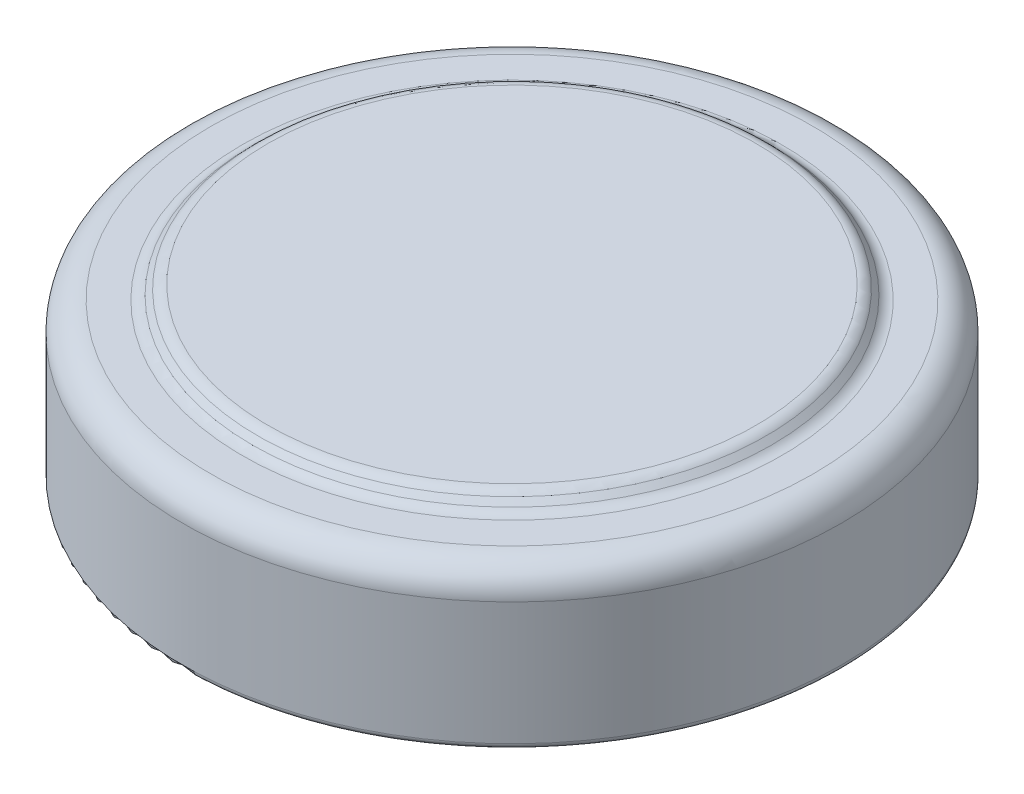
ISO-10303-21;
HEADER;
FILE_DESCRIPTION(('STEP AP214'),'2;1');
FILE_NAME('part.step','',(''),(''),'','','');
FILE_SCHEMA(('AUTOMOTIVE_DESIGN { 1 0 10303 214 1 1 1 1 }'));
ENDSEC;
DATA;
#1=APPLICATION_CONTEXT('core data for automotive mechanical design processes');
#2=APPLICATION_PROTOCOL_DEFINITION('international standard','automotive_design',2000,#1);
#3=PRODUCT_CONTEXT('',#1,'mechanical');
#4=PRODUCT('Part','Part','',(#3));
#5=PRODUCT_RELATED_PRODUCT_CATEGORY('part','',(#4));
#6=PRODUCT_DEFINITION_FORMATION('','',#4);
#7=PRODUCT_DEFINITION_CONTEXT('part definition',#1,'design');
#8=PRODUCT_DEFINITION('design','',#6,#7);
#9=PRODUCT_DEFINITION_SHAPE('','',#8);
#10=(LENGTH_UNIT() NAMED_UNIT(*) SI_UNIT(.MILLI.,.METRE.));
#11=(NAMED_UNIT(*) PLANE_ANGLE_UNIT() SI_UNIT($,.RADIAN.));
#12=(NAMED_UNIT(*) SI_UNIT($,.STERADIAN.) SOLID_ANGLE_UNIT());
#13=UNCERTAINTY_MEASURE_WITH_UNIT(LENGTH_MEASURE(1.E-05),#10,'distance_accuracy_value','');
#14=(GEOMETRIC_REPRESENTATION_CONTEXT(3) GLOBAL_UNCERTAINTY_ASSIGNED_CONTEXT((#13)) GLOBAL_UNIT_ASSIGNED_CONTEXT((#10,
#11,#12)) REPRESENTATION_CONTEXT('',''));
#15=CARTESIAN_POINT('',(0.,0.,0.));
#16=DIRECTION('',(0.,0.,1.));
#17=DIRECTION('',(1.,0.,0.));
#18=AXIS2_PLACEMENT_3D('',#15,#16,#17);
#19=CARTESIAN_POINT('',(0.,0.,0.));
#20=DIRECTION('',(0.,-1.,0.));
#21=DIRECTION('',(1.,0.,0.));
#22=AXIS2_PLACEMENT_3D('',#19,#20,#21);
#23=PLANE('',#22);
#24=DIRECTION('',(-1.,0.,0.));
#25=VECTOR('',#24,1.);
#26=CARTESIAN_POINT('',(-0.25,0.,2.));
#27=LINE('',#26,#25);
#28=CARTESIAN_POINT('',(0.25,0.,2.));
#29=VERTEX_POINT('',#28);
#30=CARTESIAN_POINT('',(-0.25,0.,2.));
#31=VERTEX_POINT('',#30);
#32=EDGE_CURVE('E1715',#29,#31,#27,.T.);
#33=ORIENTED_EDGE('',*,*,#32,.T.);
#34=DIRECTION('',(0.,0.,-1.));
#35=VECTOR('',#34,1.);
#36=CARTESIAN_POINT('',(-0.25,0.,2.));
#37=LINE('',#36,#35);
#38=CARTESIAN_POINT('',(-0.25,0.,0.25));
#39=VERTEX_POINT('',#38);
#40=EDGE_CURVE('E13',#31,#39,#37,.T.);
#41=ORIENTED_EDGE('',*,*,#40,.T.);
#42=DIRECTION('',(-1.,0.,0.));
#43=VECTOR('',#42,1.);
#44=CARTESIAN_POINT('',(-2.,0.,0.25));
#45=LINE('',#44,#43);
#46=CARTESIAN_POINT('',(-2.,0.,0.25));
#47=VERTEX_POINT('',#46);
#48=EDGE_CURVE('E1297',#39,#47,#45,.T.);
#49=ORIENTED_EDGE('',*,*,#48,.T.);
#50=DIRECTION('',(0.,0.,-1.));
#51=VECTOR('',#50,1.);
#52=CARTESIAN_POINT('',(-2.,0.,0.25));
#53=LINE('',#52,#51);
#54=CARTESIAN_POINT('',(-2.,0.,-0.25));
#55=VERTEX_POINT('',#54);
#56=EDGE_CURVE('E1742',#47,#55,#53,.T.);
#57=ORIENTED_EDGE('',*,*,#56,.T.);
#58=DIRECTION('',(1.,0.,0.));
#59=VECTOR('',#58,1.);
#60=CARTESIAN_POINT('',(-2.,0.,-0.25));
#61=LINE('',#60,#59);
#62=CARTESIAN_POINT('',(-0.25,0.,-0.25));
#63=VERTEX_POINT('',#62);
#64=EDGE_CURVE('E1739',#55,#63,#61,.T.);
#65=ORIENTED_EDGE('',*,*,#64,.T.);
#66=DIRECTION('',(0.,0.,-1.));
#67=VECTOR('',#66,1.);
#68=CARTESIAN_POINT('',(-0.25,0.,-0.25));
#69=LINE('',#68,#67);
#70=CARTESIAN_POINT('',(-0.25,0.,-2.));
#71=VERTEX_POINT('',#70);
#72=EDGE_CURVE('E1736',#63,#71,#69,.T.);
#73=ORIENTED_EDGE('',*,*,#72,.T.);
#74=DIRECTION('',(1.,0.,0.));
#75=VECTOR('',#74,1.);
#76=CARTESIAN_POINT('',(-0.25,0.,-2.));
#77=LINE('',#76,#75);
#78=CARTESIAN_POINT('',(0.25,0.,-2.));
#79=VERTEX_POINT('',#78);
#80=EDGE_CURVE('E1733',#71,#79,#77,.T.);
#81=ORIENTED_EDGE('',*,*,#80,.T.);
#82=DIRECTION('',(0.,0.,1.));
#83=VECTOR('',#82,1.);
#84=CARTESIAN_POINT('',(0.25,0.,-0.25));
#85=LINE('',#84,#83);
#86=CARTESIAN_POINT('',(0.25,0.,-0.25));
#87=VERTEX_POINT('',#86);
#88=EDGE_CURVE('E1730',#79,#87,#85,.T.);
#89=ORIENTED_EDGE('',*,*,#88,.T.);
#90=DIRECTION('',(1.,0.,0.));
#91=VECTOR('',#90,1.);
#92=CARTESIAN_POINT('',(0.25,0.,-0.25));
#93=LINE('',#92,#91);
#94=CARTESIAN_POINT('',(2.,0.,-0.25));
#95=VERTEX_POINT('',#94);
#96=EDGE_CURVE('E1727',#87,#95,#93,.T.);
#97=ORIENTED_EDGE('',*,*,#96,.T.);
#98=DIRECTION('',(0.,0.,1.));
#99=VECTOR('',#98,1.);
#100=CARTESIAN_POINT('',(2.,0.,0.25));
#101=LINE('',#100,#99);
#102=CARTESIAN_POINT('',(2.,0.,0.25));
#103=VERTEX_POINT('',#102);
#104=EDGE_CURVE('E1724',#95,#103,#101,.T.);
#105=ORIENTED_EDGE('',*,*,#104,.T.);
#106=DIRECTION('',(-1.,0.,0.));
#107=VECTOR('',#106,1.);
#108=CARTESIAN_POINT('',(0.25,0.,0.25));
#109=LINE('',#108,#107);
#110=CARTESIAN_POINT('',(0.25,0.,0.25));
#111=VERTEX_POINT('',#110);
#112=EDGE_CURVE('E1721',#103,#111,#109,.T.);
#113=ORIENTED_EDGE('',*,*,#112,.T.);
#114=DIRECTION('',(0.,0.,1.));
#115=VECTOR('',#114,1.);
#116=CARTESIAN_POINT('',(0.25,0.,2.));
#117=LINE('',#116,#115);
#118=EDGE_CURVE('E1718',#111,#29,#117,.T.);
#119=ORIENTED_EDGE('',*,*,#118,.T.);
#120=EDGE_LOOP('',(#33,#41,#49,#57,#65,#73,#81,#89,#97,#105,#113,#119));
#121=FACE_BOUND('',#120,.T.);
#122=ADVANCED_FACE('F1288',(#121),#23,.T.);
#123=ORIENTED_EDGE('',*,*,#40,.F.);
#124=ORIENTED_EDGE('',*,*,#32,.F.);
#125=ORIENTED_EDGE('',*,*,#118,.F.);
#126=ORIENTED_EDGE('',*,*,#112,.F.);
#127=ORIENTED_EDGE('',*,*,#104,.F.);
#128=ORIENTED_EDGE('',*,*,#96,.F.);
#129=ORIENTED_EDGE('',*,*,#88,.F.);
#130=ORIENTED_EDGE('',*,*,#80,.F.);
#131=ORIENTED_EDGE('',*,*,#72,.F.);
#132=ORIENTED_EDGE('',*,*,#64,.F.);
#133=ORIENTED_EDGE('',*,*,#56,.F.);
#134=ORIENTED_EDGE('',*,*,#48,.F.);
#135=EDGE_LOOP('',(#123,#124,#125,#126,#127,#128,#129,#130,#131,#132,#133,#134));
#136=FACE_BOUND('',#135,.T.);
#137=DIRECTION('',(-0.996088368152387,0.,-0.0883626778199681));
#138=VECTOR('',#137,1.);
#139=CARTESIAN_POINT('',(-0.579137112303286,0.,3.93801226233711));
#140=LINE('',#139,#138);
#141=CARTESIAN_POINT('',(-0.579137112303286,0.,3.93801226233711));
#142=VERTEX_POINT('',#141);
#143=CARTESIAN_POINT('',(-0.67849608666226,0.,3.929198159773));
#144=VERTEX_POINT('',#143);
#145=EDGE_CURVE('E1621',#142,#144,#140,.T.);
#146=ORIENTED_EDGE('',*,*,#145,.T.);
#147=DIRECTION('',(-0.0870798348311673,0.,0.996201336259783));
#148=VECTOR('',#147,1.);
#149=CARTESIAN_POINT('',(-0.67849608666226,0.,3.929198159773));
#150=LINE('',#149,#148);
#151=CARTESIAN_POINT('',(-0.765435189226363,0.,4.92378950592685));
#152=VERTEX_POINT('',#151);
#153=EDGE_CURVE('E1667',#144,#152,#150,.T.);
#154=ORIENTED_EDGE('',*,*,#153,.T.);
#155=DIRECTION('',(0.996153158484131,0.,0.0876292464996162));
#156=VECTOR('',#155,1.);
#157=CARTESIAN_POINT('',(-0.765435189226363,0.,4.92378950592685));
#158=LINE('',#157,#156);
#159=CARTESIAN_POINT('',(-0.567318202046876,0.,4.94121739054224));
#160=VERTEX_POINT('',#159);
#161=EDGE_CURVE('E1661',#152,#160,#158,.T.);
#162=ORIENTED_EDGE('',*,*,#161,.T.);
#163=CARTESIAN_POINT('',(-0.567318202046876,0.,4.94121739054224));
#164=CARTESIAN_POINT('',(-0.554031819795862,0.,4.94230303772627));
#165=CARTESIAN_POINT('',(-0.528602300257805,0.,4.94438091609498));
#166=CARTESIAN_POINT('',(-0.49215122298326,0.,4.947085506504));
#167=CARTESIAN_POINT('',(-0.459020700257985,0.,4.94879377716578));
#168=CARTESIAN_POINT('',(-0.429176751431779,0.,4.9502307880111));
#169=CARTESIAN_POINT('',(-0.402586622413116,0.,4.950241470151));
#170=CARTESIAN_POINT('',(-0.379276432405326,0.,4.95020113944004));
#171=CARTESIAN_POINT('',(-0.359269456611605,0.,4.94935900948569));
#172=CARTESIAN_POINT('',(-0.347093352547864,0.,4.94789340398217));
#173=CARTESIAN_POINT('',(-0.341556984098158,0.,4.94722700592685));
#174=B_SPLINE_CURVE_WITH_KNOTS('',3,(#163,#164,#165,#166,#167,#168,#169,#170,#171,#172,#173),
.UNSPECIFIED.,.F.,.F.,(4,1,1,1,1,1,1,1,4),(0.,0.176816665319567,0.33841889842171,
0.484771327609927,0.616842791138054,0.734639948095489,0.837381239103003,0.926058666019335,1.),.UNSPECIFIED.);
#175=CARTESIAN_POINT('',(-0.341556984098158,0.,4.94722700592685));
#176=VERTEX_POINT('',#175);
#177=EDGE_CURVE('E1653',#160,#176,#174,.T.);
#178=ORIENTED_EDGE('',*,*,#177,.T.);
#179=CARTESIAN_POINT('',(-0.341556984098158,0.,4.94722700592685));
#180=CARTESIAN_POINT('',(-0.334191615540005,0.,4.9459947182364));
#181=CARTESIAN_POINT('',(-0.319620220919844,0.,4.94355680218625));
#182=CARTESIAN_POINT('',(-0.298298972348306,0.,4.93812808339161));
#183=CARTESIAN_POINT('',(-0.277894940539209,0.,4.93109622319373));
#184=CARTESIAN_POINT('',(-0.258341783879912,0.,4.92271104109348));
#185=CARTESIAN_POINT('',(-0.239839451242335,0.,4.91264690508775));
#186=CARTESIAN_POINT('',(-0.222302561106251,0.,4.90094131418261));
#187=CARTESIAN_POINT('',(-0.205720165894403,0.,4.88763634917928));
#188=CARTESIAN_POINT('',(-0.18983541676604,0.,4.8731750028322));
#189=CARTESIAN_POINT('',(-0.175557305578979,0.,4.85705331403449));
#190=CARTESIAN_POINT('',(-0.162297062114406,0.,4.8401630662555));
#191=CARTESIAN_POINT('',(-0.151448456932673,0.,4.82166140104156));
#192=CARTESIAN_POINT('',(-0.141539025471137,0.,4.80240907801388));
#193=CARTESIAN_POINT('',(-0.134031225246251,0.,4.78171642763183));
#194=CARTESIAN_POINT('',(-0.127323922042006,0.,4.76021745663844));
#195=CARTESIAN_POINT('',(-0.123086054082073,0.,4.73740605651903));
#196=CARTESIAN_POINT('',(-0.121309585496911,0.,4.7218110166903));
#197=CARTESIAN_POINT('',(-0.120403137944312,0.,4.71385360849095));
#198=B_SPLINE_CURVE_WITH_KNOTS('',3,(#179,#180,#181,#182,#183,#184,#185,#186,#187,#188,#189,
#190,#191,#192,#193,#194,#195,#196,#197),.UNSPECIFIED.,.F.,.F.,(4,1,1,1,1,1,1,1,1,1,1,1,1,1,1,1,
4),(0.,0.0641522725937806,0.126916673940147,0.188793527915811,0.249445082754297,
0.309526691495456,0.369523301683116,0.430369965235199,0.492089652786848,0.553846670260504,
0.615245456049111,0.676256931806756,0.737843113496784,0.801038800550648,0.865121751235961,
0.931178035169152,1.),.UNSPECIFIED.);
#199=CARTESIAN_POINT('',(-0.120403137944312,0.,4.71385360849095));
#200=VERTEX_POINT('',#199);
#201=EDGE_CURVE('E1645',#176,#200,#198,.T.);
#202=ORIENTED_EDGE('',*,*,#201,.T.);
#203=CARTESIAN_POINT('',(-0.120403137944312,0.,4.71385360849095));
#204=CARTESIAN_POINT('',(-0.119614339547028,0.,4.70069503452126));
#205=CARTESIAN_POINT('',(-0.11806888244553,0.,4.67491403438602));
#206=CARTESIAN_POINT('',(-0.122374794172847,0.,4.63702728640034));
#207=CARTESIAN_POINT('',(-0.131051132825565,0.,4.60105554819271));
#208=CARTESIAN_POINT('',(-0.145201685918532,0.,4.56753295296717));
#209=CARTESIAN_POINT('',(-0.16393435754292,0.,4.53666926357308));
#210=CARTESIAN_POINT('',(-0.187129555455143,0.,4.50882694582417));
#211=CARTESIAN_POINT('',(-0.215277924348119,0.,4.48496695488491));
#212=CARTESIAN_POINT('',(-0.241735936535554,0.,4.46774920003604));
#213=CARTESIAN_POINT('',(-0.265368376291044,0.,4.45577544384549));
#214=CARTESIAN_POINT('',(-0.285180313313824,0.,4.44771389811542));
#215=CARTESIAN_POINT('',(-0.306667580904177,0.,4.44019089027859));
#216=CARTESIAN_POINT('',(-0.330029040896648,0.,4.43397023594101));
#217=CARTESIAN_POINT('',(-0.355030697280861,0.,4.42800740469518));
#218=CARTESIAN_POINT('',(-0.381899192197797,0.,4.4234436557601));
#219=CARTESIAN_POINT('',(-0.410445735060331,0.,4.41901437222066));
#220=CARTESIAN_POINT('',(-0.430152557502903,0.,4.41714257646847));
#221=CARTESIAN_POINT('',(-0.440314996918671,0.,4.41617732643967));
#222=B_SPLINE_CURVE_WITH_KNOTS('',3,(#203,#204,#205,#206,#207,#208,#209,#210,#211,#212,#213,
#214,#215,#216,#217,#218,#219,#220,#221),.UNSPECIFIED.,.F.,.F.,(4,1,1,1,1,1,1,1,1,1,1,1,1,1,1,1,
4),(0.,0.0794572220054743,0.155676949188212,0.229206104704332,0.302207288055043,
0.374390138250029,0.446500900192644,0.519963713600052,0.59633894576088,0.636544869232191,
0.679743957949855,0.725387143559754,0.773899245828747,0.825631317402164,0.880512942149488,
0.938382761101509,1.),.UNSPECIFIED.);
#223=CARTESIAN_POINT('',(-0.440314996918671,0.,4.41617732643967));
#224=VERTEX_POINT('',#223);
#225=EDGE_CURVE('E1640',#200,#224,#222,.T.);
#226=ORIENTED_EDGE('',*,*,#225,.T.);
#227=DIRECTION('',(0.678209217760568,0.,-0.734868870578009));
#228=VECTOR('',#227,1.);
#229=CARTESIAN_POINT('',(-0.440314996918671,0.,4.41617732643967));
#230=LINE('',#229,#228);
#231=CARTESIAN_POINT('',(-0.0422781379443117,0.,3.98488726233711));
#232=VERTEX_POINT('',#231);
#233=EDGE_CURVE('E1637',#224,#232,#230,.T.);
#234=ORIENTED_EDGE('',*,*,#233,.T.);
#235=DIRECTION('',(-0.996154876670358,0.,-0.0876097122804508));
#236=VECTOR('',#235,1.);
#237=CARTESIAN_POINT('',(-0.0422781379443117,0.,3.98488726233711));
#238=LINE('',#237,#236);
#239=CARTESIAN_POINT('',(-0.165274932816106,0.,3.9740699546448));
#240=VERTEX_POINT('',#239);
#241=EDGE_CURVE('E1634',#232,#240,#238,.T.);
#242=ORIENTED_EDGE('',*,*,#241,.T.);
#243=DIRECTION('',(-0.677655664718867,0.,0.735379357933326));
#244=VECTOR('',#243,1.);
#245=CARTESIAN_POINT('',(-0.165274932816106,0.,3.9740699546448));
#246=LINE('',#245,#244);
#247=CARTESIAN_POINT('',(-0.562710830252004,0.,4.40536001874736));
#248=VERTEX_POINT('',#247);
#249=EDGE_CURVE('E1631',#240,#248,#246,.T.);
#250=ORIENTED_EDGE('',*,*,#249,.T.);
#251=DIRECTION('',(-0.996448291857375,0.,-0.0842068979034344));
#252=VECTOR('',#251,1.);
#253=CARTESIAN_POINT('',(-0.562710830252004,0.,4.40536001874736));
#254=LINE('',#253,#252);
#255=CARTESIAN_POINT('',(-0.61960185589303,0.,4.40055232643967));
#256=VERTEX_POINT('',#255);
#257=EDGE_CURVE('E1628',#248,#256,#254,.T.);
#258=ORIENTED_EDGE('',*,*,#257,.T.);
#259=DIRECTION('',(0.0871508941962641,0.,-0.996195122273138));
#260=VECTOR('',#259,1.);
#261=CARTESIAN_POINT('',(-0.61960185589303,0.,4.40055232643967));
#262=LINE('',#261,#260);
#263=EDGE_CURVE('E1625',#256,#142,#262,.T.);
#264=ORIENTED_EDGE('',*,*,#263,.T.);
#265=EDGE_LOOP('',(#146,#154,#162,#178,#202,#226,#234,#242,#250,#258,#264));
#266=FACE_BOUND('',#265,.T.);
#267=DIRECTION('',(-0.955815530348748,0.,0.293967127318925));
#268=VECTOR('',#267,1.);
#269=CARTESIAN_POINT('',(1.35736434889878,0.,3.9895496881155));
#270=LINE('',#269,#268);
#271=CARTESIAN_POINT('',(1.35736434889878,0.,3.9895496881155));
#272=VERTEX_POINT('',#271);
#273=CARTESIAN_POINT('',(0.904039028385959,0.,4.12897276503858));
#274=VERTEX_POINT('',#273);
#275=EDGE_CURVE('E1488',#272,#274,#270,.T.);
#276=ORIENTED_EDGE('',*,*,#275,.T.);
#277=DIRECTION('',(0.790349486385174,0.,0.61265625710564));
#278=VECTOR('',#277,1.);
#279=CARTESIAN_POINT('',(0.904039028385959,0.,4.12897276503858));
#280=LINE('',#279,#278);
#281=CARTESIAN_POINT('',(1.66405505402698,0.,4.7181153932437));
#282=VERTEX_POINT('',#281);
#283=EDGE_CURVE('E1495',#274,#282,#280,.T.);
#284=ORIENTED_EDGE('',*,*,#283,.T.);
#285=DIRECTION('',(0.95447997803502,0.,-0.298274993135977));
#286=VECTOR('',#285,1.);
#287=CARTESIAN_POINT('',(1.66405505402698,0.,4.7181153932437));
#288=LINE('',#287,#286);
#289=CARTESIAN_POINT('',(1.68328582325775,0.,4.71210577785909));
#290=VERTEX_POINT('',#289);
#291=EDGE_CURVE('E1523',#282,#290,#288,.T.);
#292=ORIENTED_EDGE('',*,*,#291,.T.);
#293=DIRECTION('',(-0.29406549008956,0.,-0.955785272714738));
#294=VECTOR('',#293,1.);
#295=CARTESIAN_POINT('',(1.68328582325775,0.,4.71210577785909));
#296=LINE('',#295,#294);
#297=CARTESIAN_POINT('',(1.47996050274493,0.,4.05124840606422));
#298=VERTEX_POINT('',#297);
#299=EDGE_CURVE('E1520',#290,#298,#296,.T.);
#300=ORIENTED_EDGE('',*,*,#299,.T.);
#301=DIRECTION('',(0.955923177176651,0.,-0.293616892117088));
#302=VECTOR('',#301,1.);
#303=CARTESIAN_POINT('',(1.47996050274493,0.,4.05124840606422));
#304=LINE('',#303,#302);
#305=CARTESIAN_POINT('',(1.59474415659109,0.,4.01599199580781));
#306=VERTEX_POINT('',#305);
#307=EDGE_CURVE('E1517',#298,#306,#304,.T.);
#308=ORIENTED_EDGE('',*,*,#307,.T.);
#309=DIRECTION('',(-0.292753571503899,0.,-0.956187924192578));
#310=VECTOR('',#309,1.);
#311=CARTESIAN_POINT('',(1.59474415659109,0.,4.01599199580781));
#312=LINE('',#311,#310);
#313=CARTESIAN_POINT('',(1.56689960530904,0.,3.92504648298729));
#314=VERTEX_POINT('',#313);
#315=EDGE_CURVE('E1514',#306,#314,#312,.T.);
#316=ORIENTED_EDGE('',*,*,#315,.T.);
#317=DIRECTION('',(-0.955923177176653,0.,0.293616892117082));
#318=VECTOR('',#317,1.);
#319=CARTESIAN_POINT('',(1.56689960530904,0.,3.92504648298729));
#320=LINE('',#319,#318);
#321=CARTESIAN_POINT('',(1.45211595146288,0.,3.9603028932437));
#322=VERTEX_POINT('',#321);
#323=EDGE_CURVE('E1511',#314,#322,#320,.T.);
#324=ORIENTED_EDGE('',*,*,#323,.T.);
#325=DIRECTION('',(-0.294268837701824,0.,-0.955722685279374));
#326=VECTOR('',#325,1.);
#327=CARTESIAN_POINT('',(1.45211595146288,0.,3.9603028932437));
#328=LINE('',#327,#326);
#329=CARTESIAN_POINT('',(1.38420729761673,0.,3.73975000862832));
#330=VERTEX_POINT('',#329);
#331=EDGE_CURVE('E1508',#322,#330,#328,.T.);
#332=ORIENTED_EDGE('',*,*,#331,.T.);
#333=DIRECTION('',(-0.955516559654642,0.,0.294937458159787));
#334=VECTOR('',#333,1.);
#335=CARTESIAN_POINT('',(1.38420729761673,0.,3.73975000862832));
#336=LINE('',#335,#334);
#337=CARTESIAN_POINT('',(1.28945569505263,0.,3.76899680350011));
#338=VERTEX_POINT('',#337);
#339=EDGE_CURVE('E1490',#330,#338,#336,.T.);
#340=ORIENTED_EDGE('',*,*,#339,.T.);
#341=DIRECTION('',(0.294268837701825,0.,0.955722685279374));
#342=VECTOR('',#341,1.);
#343=CARTESIAN_POINT('',(1.28945569505263,0.,3.76899680350011));
#344=LINE('',#343,#342);
#345=EDGE_CURVE('E1484',#338,#272,#344,.T.);
#346=ORIENTED_EDGE('',*,*,#345,.T.);
#347=EDGE_LOOP('',(#276,#284,#292,#300,#308,#316,#324,#332,#340,#346));
#348=FACE_BOUND('',#347,.T.);
#349=CARTESIAN_POINT('',(0.,0.,0.));
#350=DIRECTION('',(0.,1.,0.));
#351=DIRECTION('',(-1.,0.,0.));
#352=AXIS2_PLACEMENT_3D('',#349,#350,#351);
#353=CIRCLE('',#352,5.7);
#354=CARTESIAN_POINT('',(-5.7,0.,0.));
#355=VERTEX_POINT('',#354);
#356=EDGE_CURVE('E1497',#355,#355,#353,.T.);
#357=ORIENTED_EDGE('',*,*,#356,.F.);
#358=EDGE_LOOP('',(#357));
#359=FACE_BOUND('',#358,.T.);
#360=DIRECTION('',(0.285179129600152,0.,0.958474237546581));
#361=VECTOR('',#360,1.);
#362=CARTESIAN_POINT('',(0.245747685048687,0.,4.47979669320451));
#363=LINE('',#362,#361);
#364=CARTESIAN_POINT('',(0.245747685048687,0.,4.47979669320451));
#365=VERTEX_POINT('',#364);
#366=CARTESIAN_POINT('',(0.388375890176892,0.,4.959163680384));
#367=VERTEX_POINT('',#366);
#368=EDGE_CURVE('E1538',#365,#367,#363,.T.);
#369=ORIENTED_EDGE('',*,*,#368,.T.);
#370=DIRECTION('',(0.994515681786388,0.,-0.104587564657349));
#371=VECTOR('',#370,1.);
#372=CARTESIAN_POINT('',(0.388375890176892,0.,4.959163680384));
#373=LINE('',#372,#371);
#374=CARTESIAN_POINT('',(0.815058582484585,0.,4.91429188551221));
#375=VERTEX_POINT('',#374);
#376=EDGE_CURVE('E1618',#367,#375,#373,.T.);
#377=ORIENTED_EDGE('',*,*,#376,.T.);
#378=DIRECTION('',(-0.104131650808058,0.,-0.994563522003491));
#379=VECTOR('',#378,1.);
#380=CARTESIAN_POINT('',(0.815058582484585,0.,4.91429188551221));
#381=LINE('',#380,#379);
#382=CARTESIAN_POINT('',(0.80524287735638,0.,4.82054188551221));
#383=VERTEX_POINT('',#382);
#384=EDGE_CURVE('E1615',#375,#383,#381,.T.);
#385=ORIENTED_EDGE('',*,*,#384,.T.);
#386=DIRECTION('',(-0.994530308301738,0.,0.104448388543103));
#387=VECTOR('',#386,1.);
#388=CARTESIAN_POINT('',(0.80524287735638,0.,4.82054188551221));
#389=LINE('',#388,#387);
#390=CARTESIAN_POINT('',(0.454281338894841,0.,4.85740085987118));
#391=VERTEX_POINT('',#390);
#392=EDGE_CURVE('E1612',#383,#391,#389,.T.);
#393=ORIENTED_EDGE('',*,*,#392,.T.);
#394=DIRECTION('',(-0.280980732036108,0.,-0.959713409422028));
#395=VECTOR('',#394,1.);
#396=CARTESIAN_POINT('',(0.454281338894841,0.,4.85740085987118));
#397=LINE('',#396,#395);
#398=CARTESIAN_POINT('',(0.377157941458944,0.,4.59397938551221));
#399=VERTEX_POINT('',#398);
#400=EDGE_CURVE('E1606',#391,#399,#397,.T.);
#401=ORIENTED_EDGE('',*,*,#400,.T.);
#402=CARTESIAN_POINT('',(0.377157941458944,0.,4.59397938551221));
#403=CARTESIAN_POINT('',(0.38782504727767,0.,4.59570249323625));
#404=CARTESIAN_POINT('',(0.40855620627378,0.,4.59905129475763));
#405=CARTESIAN_POINT('',(0.438924564617193,0.,4.60192977288561));
#406=CARTESIAN_POINT('',(0.467535176956713,0.,4.60243533983015));
#407=CARTESIAN_POINT('',(0.485870593630788,0.,4.60105689531318));
#408=CARTESIAN_POINT('',(0.494746082484585,0.,4.60038964192246));
#409=B_SPLINE_CURVE_WITH_KNOTS('',3,(#402,#403,#404,#405,#406,#407,#408),.UNSPECIFIED.,.F.,.F.,
(4,1,1,1,4),(0.,0.274365484456612,0.533220029685043,0.7740492895608,1.),.UNSPECIFIED.);
#410=CARTESIAN_POINT('',(0.494746082484585,0.,4.60038964192246));
#411=VERTEX_POINT('',#410);
#412=EDGE_CURVE('E1598',#399,#411,#409,.T.);
#413=ORIENTED_EDGE('',*,*,#412,.T.);
#414=CARTESIAN_POINT('',(0.494746082484585,0.,4.60038964192246));
#415=CARTESIAN_POINT('',(0.505737745353715,0.,4.59901564477357));
#416=CARTESIAN_POINT('',(0.527312783771768,0.,4.59631868785025));
#417=CARTESIAN_POINT('',(0.558426575107297,0.,4.58844737912764));
#418=CARTESIAN_POINT('',(0.587910630341213,0.,4.57857192024041));
#419=CARTESIAN_POINT('',(0.615536607035652,0.,4.56567663368012));
#420=CARTESIAN_POINT('',(0.64128578394499,0.,4.54987640791519));
#421=CARTESIAN_POINT('',(0.665441087183722,0.,4.53169534894466));
#422=CARTESIAN_POINT('',(0.68756199694163,0.,4.51057534795466));
#423=CARTESIAN_POINT('',(0.707933008017845,0.,4.48732347776406));
#424=CARTESIAN_POINT('',(0.725825085977435,0.,4.46196153384259));
#425=CARTESIAN_POINT('',(0.741236897110102,0.,4.43521396424425));
#426=CARTESIAN_POINT('',(0.753518920066416,0.,4.40699112792321));
#427=CARTESIAN_POINT('',(0.762689832918766,0.,4.3774074561121));
#428=CARTESIAN_POINT('',(0.769109481325097,0.,4.34661703211611));
#429=CARTESIAN_POINT('',(0.772728506301728,0.,4.31456847359947));
#430=CARTESIAN_POINT('',(0.773336538367636,0.,4.28123215034057));
#431=CARTESIAN_POINT('',(0.771515145797022,0.,4.2587008052743));
#432=CARTESIAN_POINT('',(0.770587428638431,0.,4.2472245778199));
#433=B_SPLINE_CURVE_WITH_KNOTS('',3,(#414,#415,#416,#417,#418,#419,#420,#421,#422,#423,#424,
#425,#426,#427,#428,#429,#430,#431,#432),.UNSPECIFIED.,.F.,.F.,(4,1,1,1,1,1,1,1,1,1,1,1,1,1,1,1,
4),(0.,0.0660805575587869,0.129706540765659,0.191233148454119,0.251518828274914,
0.311278852850805,0.371321476221812,0.431674351693954,0.493557727956686,0.555615517861014,
0.616687053309626,0.677570908492328,0.738979858306743,0.801298353418647,0.865093986256453,
0.931286299413816,1.),.UNSPECIFIED.);
#434=CARTESIAN_POINT('',(0.770587428638431,0.,4.2472245778199));
#435=VERTEX_POINT('',#434);
#436=EDGE_CURVE('E1590',#411,#435,#433,.T.);
#437=ORIENTED_EDGE('',*,*,#436,.T.);
#438=CARTESIAN_POINT('',(0.770587428638431,0.,4.2472245778199));
#439=CARTESIAN_POINT('',(0.769625511283539,0.,4.23919578730215));
#440=CARTESIAN_POINT('',(0.767723954423391,0.,4.22332415175042));
#441=CARTESIAN_POINT('',(0.763035619586273,0.,4.19997747763374));
#442=CARTESIAN_POINT('',(0.756983330842902,0.,4.17733075403272));
#443=CARTESIAN_POINT('',(0.749810375962319,0.,4.15521554374803));
#444=CARTESIAN_POINT('',(0.741210022964038,0.,4.13378384096971));
#445=CARTESIAN_POINT('',(0.731137953752785,0.,4.11304930217114));
#446=CARTESIAN_POINT('',(0.719654091561637,0.,4.09304497784712));
#447=CARTESIAN_POINT('',(0.707147740445984,0.,4.07361805616028));
#448=CARTESIAN_POINT('',(0.69331365404882,0.,4.055304711541));
#449=CARTESIAN_POINT('',(0.678752155233026,0.,4.03803262552887));
#450=CARTESIAN_POINT('',(0.663218314425626,0.,4.02210327181065));
#451=CARTESIAN_POINT('',(0.646830973333039,0.,4.00749425921719));
#452=CARTESIAN_POINT('',(0.629483918140111,0.,3.99417782264267));
#453=CARTESIAN_POINT('',(0.611233823101423,0.,3.98220038698636));
#454=CARTESIAN_POINT('',(0.592213595687662,0.,3.97132639320403));
#455=CARTESIAN_POINT('',(0.57232169591347,0.,3.96189213054048));
#456=CARTESIAN_POINT('',(0.551739742795398,0.,3.95395054209288));
#457=CARTESIAN_POINT('',(0.53054857837599,0.,3.94724439868885));
#458=CARTESIAN_POINT('',(0.508715162026132,0.,3.9420790999484));
#459=CARTESIAN_POINT('',(0.486232238750166,0.,3.93826296067186));
#460=CARTESIAN_POINT('',(0.463213901498868,0.,3.93589797978273));
#461=CARTESIAN_POINT('',(0.4395986471504,0.,3.93482919305885));
#462=CARTESIAN_POINT('',(0.415385192653222,0.,3.93552265268482));
#463=CARTESIAN_POINT('',(0.399054523837288,0.,3.93685431077674));
#464=CARTESIAN_POINT('',(0.390779736330739,0.,3.93752906499939));
#465=B_SPLINE_CURVE_WITH_KNOTS('',3,(#438,#439,#440,#441,#442,#443,#444,#445,#446,#447,#448,
#449,#450,#451,#452,#453,#454,#455,#456,#457,#458,#459,#460,#461,#462,#463,#464),.UNSPECIFIED.,
.F.,.F.,(4,1,1,1,1,1,1,1,1,1,1,1,1,1,1,1,1,1,1,1,1,1,1,1,4),(0.,0.0441663352831678,
0.0873097854178418,0.129963023673315,0.172188174185174,0.214258589675982,0.256028968942633,
0.298021803110851,0.340218575442705,0.38217335825447,0.423327403656189,0.463573978501844,
0.503626624774078,0.54317599098897,0.582941828610556,0.622807950111011,0.662789087107013,
0.703100097488046,0.743253968681831,0.784135446248661,0.825579539412281,0.867762115494887,
0.910485505868138,0.954642799627732,1.),.UNSPECIFIED.);
#466=CARTESIAN_POINT('',(0.390779736330739,0.,3.93752906499939));
#467=VERTEX_POINT('',#466);
#468=EDGE_CURVE('E1582',#435,#467,#465,.T.);
#469=ORIENTED_EDGE('',*,*,#468,.T.);
#470=CARTESIAN_POINT('',(0.390779736330739,0.,3.93752906499939));
#471=CARTESIAN_POINT('',(0.381002058428765,0.,3.93875979246739));
#472=CARTESIAN_POINT('',(0.361769303574907,0.,3.94118064125393));
#473=CARTESIAN_POINT('',(0.333827264961299,0.,3.94770327146802));
#474=CARTESIAN_POINT('',(0.307254720655197,0.,3.95627716073807));
#475=CARTESIAN_POINT('',(0.282154983340444,0.,3.96717790269678));
#476=CARTESIAN_POINT('',(0.258351493869053,0.,3.98000084246081));
#477=CARTESIAN_POINT('',(0.236017193424554,0.,3.99511381059006));
#478=CARTESIAN_POINT('',(0.215105982807135,0.,4.01243615309418));
#479=CARTESIAN_POINT('',(0.195772072546152,0.,4.0317412964289));
#480=CARTESIAN_POINT('',(0.178420666499083,0.,4.0528371265644));
#481=CARTESIAN_POINT('',(0.162828908599761,0.,4.07501189058878));
#482=CARTESIAN_POINT('',(0.149915222689813,0.,4.09864646375607));
#483=CARTESIAN_POINT('',(0.138689386018614,0.,4.12311682718363));
#484=CARTESIAN_POINT('',(0.130147144620989,0.,4.14887846829798));
#485=CARTESIAN_POINT('',(0.123790907855835,0.,4.17569914689588));
#486=CARTESIAN_POINT('',(0.119167233808641,0.,4.20360739620502));
#487=CARTESIAN_POINT('',(0.118222740839737,0.,4.22270038654455));
#488=CARTESIAN_POINT('',(0.117742877356379,0.,4.23240085987118));
#489=B_SPLINE_CURVE_WITH_KNOTS('',3,(#470,#471,#472,#473,#474,#475,#476,#477,#478,#479,#480,
#481,#482,#483,#484,#485,#486,#487,#488),.UNSPECIFIED.,.F.,.F.,(4,1,1,1,1,1,1,1,1,1,1,1,1,1,1,1,
4),(0.,0.066971033911429,0.131732451246732,0.194764606698107,0.256588175989059,0.31753693834935,
0.378360427449551,0.439633028772253,0.50191670378294,0.563828572273325,0.625165064040911,
0.685934300938009,0.746695056552614,0.808002973983252,0.870112641819113,0.934008825695018,1.),.UNSPECIFIED.);
#490=CARTESIAN_POINT('',(0.117742877356379,0.,4.23240085987118));
#491=VERTEX_POINT('',#490);
#492=EDGE_CURVE('E1577',#467,#491,#489,.T.);
#493=ORIENTED_EDGE('',*,*,#492,.T.);
#494=DIRECTION('',(0.994516259926724,0.,-0.104582067016104));
#495=VECTOR('',#494,1.);
#496=CARTESIAN_POINT('',(0.117742877356379,0.,4.23240085987118));
#497=LINE('',#496,#495);
#498=CARTESIAN_POINT('',(0.218704415817918,0.,4.22178387269169));
#499=VERTEX_POINT('',#498);
#500=EDGE_CURVE('E1571',#491,#499,#497,.T.);
#501=ORIENTED_EDGE('',*,*,#500,.T.);
#502=CARTESIAN_POINT('',(0.218704415817918,0.,4.22178387269169));
#503=CARTESIAN_POINT('',(0.219753443157421,0.,4.21246397809155));
#504=CARTESIAN_POINT('',(0.221772722502286,0.,4.1945240541699));
#505=CARTESIAN_POINT('',(0.228250661173624,0.,4.16909291771605));
#506=CARTESIAN_POINT('',(0.236192454399062,0.,4.14587199329564));
#507=CARTESIAN_POINT('',(0.247025019415246,0.,4.12508145932563));
#508=CARTESIAN_POINT('',(0.26025160924657,0.,4.1064871090371));
#509=CARTESIAN_POINT('',(0.275720668627522,0.,4.08941319273915));
#510=CARTESIAN_POINT('',(0.293586516636313,0.,4.07380622342845));
#511=CARTESIAN_POINT('',(0.313716036836005,0.,4.05984561084922));
#512=CARTESIAN_POINT('',(0.335545958117078,0.,4.04820775531695));
#513=CARTESIAN_POINT('',(0.358404776425379,0.,4.03884930854234));
#514=CARTESIAN_POINT('',(0.38206803922027,0.,4.03213575077971));
#515=CARTESIAN_POINT('',(0.398289985080219,0.,4.02982887401786));
#516=CARTESIAN_POINT('',(0.406404736330738,0.,4.02867489833272));
#517=B_SPLINE_CURVE_WITH_KNOTS('',3,(#502,#503,#504,#505,#506,#507,#508,#509,#510,#511,#512,
#513,#514,#515,#516),.UNSPECIFIED.,.F.,.F.,(4,1,1,1,1,1,1,1,1,1,1,1,4),(0.,0.09568197971453,
0.184178846477956,0.267446456057745,0.345842880637179,0.422669060289275,0.499926927407317,
0.58063873902542,0.664449231497127,0.749581303285845,0.832790237295001,0.916356173129669,1.),.UNSPECIFIED.);
#518=CARTESIAN_POINT('',(0.406404736330738,0.,4.02867489833272));
#519=VERTEX_POINT('',#518);
#520=EDGE_CURVE('E1563',#499,#519,#517,.T.);
#521=ORIENTED_EDGE('',*,*,#520,.T.);
#522=CARTESIAN_POINT('',(0.406404736330738,0.,4.02867489833272));
#523=CARTESIAN_POINT('',(0.414413106426555,0.,4.0280317219961));
#524=CARTESIAN_POINT('',(0.43015693918226,0.,4.02676728734149));
#525=CARTESIAN_POINT('',(0.453656564505092,0.,4.02791797790179));
#526=CARTESIAN_POINT('',(0.476548184935586,0.,4.03114390230084));
#527=CARTESIAN_POINT('',(0.498701980899346,0.,4.03747719617872));
#528=CARTESIAN_POINT('',(0.520488257982151,0.,4.04526021748959));
#529=CARTESIAN_POINT('',(0.541406246080482,0.,4.05611548975527));
#530=CARTESIAN_POINT('',(0.561723249569128,0.,4.06919737278377));
#531=CARTESIAN_POINT('',(0.581158043207516,0.,4.08450855449658));
#532=CARTESIAN_POINT('',(0.599366908790733,0.,4.10169803798001));
#533=CARTESIAN_POINT('',(0.615810500921012,0.,4.12038713880111));
#534=CARTESIAN_POINT('',(0.62987902433525,0.,4.14073917958712));
#535=CARTESIAN_POINT('',(0.642262163972664,0.,4.16214665753781));
#536=CARTESIAN_POINT('',(0.652159421646345,0.,4.18522123081849));
#537=CARTESIAN_POINT('',(0.660527158244381,0.,4.20938778577629));
#538=CARTESIAN_POINT('',(0.666277736739114,0.,4.23515306768455));
#539=CARTESIAN_POINT('',(0.668625185312182,0.,4.25281275000397));
#540=CARTESIAN_POINT('',(0.669826210689713,0.,4.2618479752558));
#541=B_SPLINE_CURVE_WITH_KNOTS('',3,(#522,#523,#524,#525,#526,#527,#528,#529,#530,#531,#532,
#533,#534,#535,#536,#537,#538,#539,#540),.UNSPECIFIED.,.F.,.F.,(4,1,1,1,1,1,1,1,1,1,1,1,1,1,1,1,
4),(0.,0.0614418043463065,0.120789808695568,0.179704803655903,0.237984427717423,
0.296852839907465,0.356516971100172,0.417909854264471,0.481614739346341,0.545614233985241,
0.609374462049513,0.671767797032078,0.734723902735858,0.798352869254704,0.863655661624635,
0.930242130818035,1.),.UNSPECIFIED.);
#542=CARTESIAN_POINT('',(0.669826210689713,0.,4.2618479752558));
#543=VERTEX_POINT('',#542);
#544=EDGE_CURVE('E1555',#519,#543,#541,.T.);
#545=ORIENTED_EDGE('',*,*,#544,.T.);
#546=CARTESIAN_POINT('',(0.669826210689713,0.,4.2618479752558));
#547=CARTESIAN_POINT('',(0.670499119634796,0.,4.26998792510766));
#548=CARTESIAN_POINT('',(0.671816070388556,0.,4.28591862891432));
#549=CARTESIAN_POINT('',(0.671407313904617,0.,4.30953105854593));
#550=CARTESIAN_POINT('',(0.66885223326256,0.,4.33222011642516));
#551=CARTESIAN_POINT('',(0.664037161614028,0.,4.35389757712351));
#552=CARTESIAN_POINT('',(0.657133919060317,0.,4.37454852819706));
#553=CARTESIAN_POINT('',(0.648300835050999,0.,4.39432930060396));
#554=CARTESIAN_POINT('',(0.637278908208998,0.,4.4131312579314));
#555=CARTESIAN_POINT('',(0.624235435337566,0.,4.43077896729414));
#556=CARTESIAN_POINT('',(0.609381023519155,0.,4.44700218167188));
#557=CARTESIAN_POINT('',(0.593013902565442,0.,4.46168116753894));
#558=CARTESIAN_POINT('',(0.57491421033444,0.,4.47435779065654));
#559=CARTESIAN_POINT('',(0.555483483539792,0.,4.48549287358736));
#560=CARTESIAN_POINT('',(0.534314969580797,0.,4.49443848438835));
#561=CARTESIAN_POINT('',(0.511695788973887,0.,4.50160532842018));
#562=CARTESIAN_POINT('',(0.487684466886893,0.,4.5073739742021));
#563=CARTESIAN_POINT('',(0.471002708201576,0.,4.50940820775775));
#564=CARTESIAN_POINT('',(0.462494479920482,0.,4.51044573166605));
#565=B_SPLINE_CURVE_WITH_KNOTS('',3,(#546,#547,#548,#549,#550,#551,#552,#553,#554,#555,#556,
#557,#558,#559,#560,#561,#562,#563,#564),.UNSPECIFIED.,.F.,.F.,(4,1,1,1,1,1,1,1,1,1,1,1,1,1,1,1,
4),(0.,0.067164632996928,0.131447968848637,0.193933961703211,0.254711038835376,
0.313775741013202,0.37278932703937,0.432618052949685,0.492718546005601,0.552989523031873,
0.613300543897476,0.673202365407332,0.734459197428729,0.797215067800125,0.86184253657097,
0.929535293024849,1.),.UNSPECIFIED.);
#566=CARTESIAN_POINT('',(0.462494479920482,0.,4.51044573166605));
#567=VERTEX_POINT('',#566);
#568=EDGE_CURVE('E1547',#543,#567,#565,.T.);
#569=ORIENTED_EDGE('',*,*,#568,.T.);
#570=CARTESIAN_POINT('',(0.462494479920482,0.,4.51044573166605));
#571=CARTESIAN_POINT('',(0.455021444916534,0.,4.5110915148132));
#572=CARTESIAN_POINT('',(0.43962848839758,0.,4.51242169885483));
#573=CARTESIAN_POINT('',(0.415789435194627,0.,4.51228259587215));
#574=CARTESIAN_POINT('',(0.39065825401108,0.,4.51059559124431));
#575=CARTESIAN_POINT('',(0.364173652846941,0.,4.50760399161742));
#576=CARTESIAN_POINT('',(0.336361927460006,0.,4.50297780822789));
#577=CARTESIAN_POINT('',(0.307270762904629,0.,4.49662757002118));
#578=CARTESIAN_POINT('',(0.276818164575546,0.,4.48913517723927));
#579=CARTESIAN_POINT('',(0.256272549623752,0.,4.48296002641658));
#580=CARTESIAN_POINT('',(0.245747685048687,0.,4.47979669320451));
#581=B_SPLINE_CURVE_WITH_KNOTS('',3,(#570,#571,#572,#573,#574,#575,#576,#577,#578,#579,#580),
.UNSPECIFIED.,.F.,.F.,(4,1,1,1,1,1,1,1,4),(0.,0.10209657623406,0.21029851430838,
0.324188544971323,0.444983314609848,0.573088979222001,0.707911111113385,0.850372159381658,1.),.UNSPECIFIED.);
#582=EDGE_CURVE('E1542',#567,#365,#581,.T.);
#583=ORIENTED_EDGE('',*,*,#582,.T.);
#584=EDGE_LOOP('',(#369,#377,#385,#393,#401,#413,#437,#469,#493,#501,#521,#545,#569,#583));
#585=FACE_BOUND('',#584,.T.);
#586=DIRECTION('',(-0.961304453443789,0.,-0.275488199001587));
#587=VECTOR('',#586,1.);
#588=CARTESIAN_POINT('',(-0.838450131693838,0.,3.90624309338154));
#589=LINE('',#588,#587);
#590=CARTESIAN_POINT('',(-0.838450131693838,0.,3.90624309338154));
#591=VERTEX_POINT('',#590);
#592=CARTESIAN_POINT('',(-1.30259275989897,0.,3.77323027286872));
#593=VERTEX_POINT('',#592);
#594=EDGE_CURVE('E1696',#591,#593,#589,.T.);
#595=ORIENTED_EDGE('',*,*,#594,.T.);
#596=DIRECTION('',(-0.275650418276929,0.,0.961257950242158));
#597=VECTOR('',#596,1.);
#598=CARTESIAN_POINT('',(-1.30259275989897,0.,3.77323027286872));
#599=LINE('',#598,#597);
#600=CARTESIAN_POINT('',(-1.57723218297589,0.,4.7309626446636));
#601=VERTEX_POINT('',#600);
#602=EDGE_CURVE('E1712',#593,#601,#599,.T.);
#603=ORIENTED_EDGE('',*,*,#602,.T.);
#604=DIRECTION('',(0.961221725475995,0.,0.275776711259221));
#605=VECTOR('',#604,1.);
#606=CARTESIAN_POINT('',(-1.57723218297589,0.,4.7309626446636));
#607=LINE('',#606,#605);
#608=CARTESIAN_POINT('',(-1.48087801630922,0.,4.75860687543283));
#609=VERTEX_POINT('',#608);
#610=EDGE_CURVE('E1709',#601,#609,#607,.T.);
#611=ORIENTED_EDGE('',*,*,#610,.T.);
#612=DIRECTION('',(0.275749778041608,0.,-0.961229452269334));
#613=VECTOR('',#612,1.);
#614=CARTESIAN_POINT('',(-1.48087801630922,0.,4.75860687543283));
#615=LINE('',#614,#613);
#616=CARTESIAN_POINT('',(-1.23268090092461,0.,3.89342258056103));
#617=VERTEX_POINT('',#616);
#618=EDGE_CURVE('E1706',#609,#617,#615,.T.);
#619=ORIENTED_EDGE('',*,*,#618,.T.);
#620=DIRECTION('',(0.961326114766016,0.,0.275412601507041));
#621=VECTOR('',#620,1.);
#622=CARTESIAN_POINT('',(-1.23268090092461,0.,3.89342258056103));
#623=LINE('',#622,#621);
#624=CARTESIAN_POINT('',(-0.864892439386145,0.,3.99879117030462));
#625=VERTEX_POINT('',#624);
#626=EDGE_CURVE('E1703',#617,#625,#623,.T.);
#627=ORIENTED_EDGE('',*,*,#626,.T.);
#628=DIRECTION('',(0.274721127897376,0.,-0.961523947640824));
#629=VECTOR('',#628,1.);
#630=CARTESIAN_POINT('',(-0.864892439386145,0.,3.99879117030462));
#631=LINE('',#630,#629);
#632=EDGE_CURVE('E1700',#625,#591,#631,.T.);
#633=ORIENTED_EDGE('',*,*,#632,.T.);
#634=EDGE_LOOP('',(#595,#603,#611,#619,#627,#633));
#635=FACE_BOUND('',#634,.T.);
#636=ADVANCED_FACE('F1486',(#136,#266,#348,#359,#585,#635),#23,.T.);
#637=CARTESIAN_POINT('',(-0.223768522559696,0.,4.70483918541403));
#638=CARTESIAN_POINT('',(-0.22478918870725,0.,4.71296741286565));
#639=CARTESIAN_POINT('',(-0.226814025202568,0.,4.7290925010012));
#640=CARTESIAN_POINT('',(-0.234174143018535,0.,4.75219961851296));
#641=CARTESIAN_POINT('',(-0.244824128692869,0.,4.77378597440967));
#642=CARTESIAN_POINT('',(-0.258296946711959,0.,4.79368705553308));
#643=CARTESIAN_POINT('',(-0.274488931332382,0.,4.81124040063288));
#644=CARTESIAN_POINT('',(-0.292708244962694,0.,4.82613546964683));
#645=CARTESIAN_POINT('',(-0.312923696831256,0.,4.83782052984167));
#646=CARTESIAN_POINT('',(-0.331383552702118,0.,4.84500956072191));
#647=CARTESIAN_POINT('',(-0.347672086154187,0.,4.84893572256407));
#648=CARTESIAN_POINT('',(-0.361732042094444,0.,4.85127970233205));
#649=CARTESIAN_POINT('',(-0.377573788000173,0.,4.85309511467503));
#650=CARTESIAN_POINT('',(-0.395163293633263,0.,4.85402784839717));
#651=CARTESIAN_POINT('',(-0.414544889239536,0.,4.85421264771256));
#652=CARTESIAN_POINT('',(-0.435651461795188,0.,4.85352477115424));
#653=CARTESIAN_POINT('',(-0.458561001413434,0.,4.85233737768101));
#654=CARTESIAN_POINT('',(-0.474371893643283,0.,4.8511097274783));
#655=CARTESIAN_POINT('',(-0.482582625123799,0.,4.85047219823454));
#656=B_SPLINE_CURVE_WITH_KNOTS('',3,(#637,#638,#639,#640,#641,#642,#643,#644,#645,#646,#647,
#648,#649,#650,#651,#652,#653,#654,#655),.UNSPECIFIED.,.F.,.F.,(4,1,1,1,1,1,1,1,1,1,1,1,1,1,1,1,
4),(0.,0.072435918617708,0.14370114257302,0.213526115895236,0.285043641602739,0.355776844280258,
0.424310078650517,0.492677252116761,0.561759452411993,0.598909376616227,0.640911082601269,
0.68793368245048,0.740060588955332,0.79683781694161,0.859551040020519,0.927063654577816,1.),.UNSPECIFIED.);
#657=CARTESIAN_POINT('',(-0.223768522559696,0.,4.70483918541403));
#658=VERTEX_POINT('',#657);
#659=CARTESIAN_POINT('',(-0.482582625123799,0.,4.85047219823454));
#660=VERTEX_POINT('',#659);
#661=EDGE_CURVE('E1670',#658,#660,#656,.T.);
#662=ORIENTED_EDGE('',*,*,#661,.T.);
#663=DIRECTION('',(-0.996240588195683,0.,-0.0866296163648385));
#664=VECTOR('',#663,1.);
#665=CARTESIAN_POINT('',(-0.482582625123799,0.,4.85047219823454));
#666=LINE('',#665,#664);
#667=CARTESIAN_POINT('',(-0.657662753328927,0.,4.83524783926018));
#668=VERTEX_POINT('',#667);
#669=EDGE_CURVE('E1693',#660,#668,#666,.T.);
#670=ORIENTED_EDGE('',*,*,#669,.T.);
#671=DIRECTION('',(0.0873426496280564,0.,-0.996178328190265));
#672=VECTOR('',#671,1.);
#673=CARTESIAN_POINT('',(-0.657662753328927,0.,4.83524783926018));
#674=LINE('',#673,#672);
#675=CARTESIAN_POINT('',(-0.628015317431491,0.,4.49710681361916));
#676=VERTEX_POINT('',#675);
#677=EDGE_CURVE('E1690',#668,#676,#674,.T.);
#678=ORIENTED_EDGE('',*,*,#677,.T.);
#679=DIRECTION('',(0.996943722135499,0.,0.0781230753018464));
#680=VECTOR('',#679,1.);
#681=CARTESIAN_POINT('',(-0.628015317431491,0.,4.49710681361916));
#682=LINE('',#681,#680);
#683=CARTESIAN_POINT('',(-0.456741278969953,0.,4.51052828797813));
#684=VERTEX_POINT('',#683);
#685=EDGE_CURVE('E1684',#676,#684,#682,.T.);
#686=ORIENTED_EDGE('',*,*,#685,.T.);
#687=CARTESIAN_POINT('',(-0.456741278969953,0.,4.51052828797813));
#688=CARTESIAN_POINT('',(-0.448724604167376,0.,4.51129120075838));
#689=CARTESIAN_POINT('',(-0.433270849249346,0.,4.51276186876229));
#690=CARTESIAN_POINT('',(-0.410939896036923,0.,4.51551275736413));
#691=CARTESIAN_POINT('',(-0.390308720679491,0.,4.51895049075139));
#692=CARTESIAN_POINT('',(-0.371261688623245,0.,4.52272850142895));
#693=CARTESIAN_POINT('',(-0.353862652105844,0.,4.52686446868988));
#694=CARTESIAN_POINT('',(-0.33816343249224,0.,4.5315097675606));
#695=CARTESIAN_POINT('',(-0.324081402484263,0.,4.53636042734941));
#696=CARTESIAN_POINT('',(-0.3079074678728,0.,4.54390211631636));
#697=CARTESIAN_POINT('',(-0.289758878612473,0.,4.55446120603044));
#698=CARTESIAN_POINT('',(-0.270773166415627,0.,4.57012538963492));
#699=CARTESIAN_POINT('',(-0.254885046393633,0.,4.58856835916215));
#700=CARTESIAN_POINT('',(-0.241836885283431,0.,4.60922100732724));
#701=CARTESIAN_POINT('',(-0.23203716696002,0.,4.63166975151235));
#702=CARTESIAN_POINT('',(-0.225634762978219,0.,4.65528339118762));
#703=CARTESIAN_POINT('',(-0.222380469755586,0.,4.67985750455463));
#704=CARTESIAN_POINT('',(-0.223300754296975,0.,4.69642045853213));
#705=CARTESIAN_POINT('',(-0.223768522559696,0.,4.70483918541403));
#706=B_SPLINE_CURVE_WITH_KNOTS('',3,(#687,#688,#689,#690,#691,#692,#693,#694,#695,#696,#697,
#698,#699,#700,#701,#702,#703,#704,#705),.UNSPECIFIED.,.F.,.F.,(4,1,1,1,1,1,1,1,1,1,1,1,1,1,1,1,
4),(0.,0.0698671968540688,0.134683090381248,0.195162116346701,0.251289094575451,
0.303138961292976,0.350250864350552,0.39331319462093,0.43219789742307,0.504927211701751,
0.574876026336372,0.644690360840446,0.715250677906131,0.786074497670028,0.856346447460945,
0.926982830110844,1.),.UNSPECIFIED.);
#707=EDGE_CURVE('E1676',#684,#658,#706,.T.);
#708=ORIENTED_EDGE('',*,*,#707,.T.);
#709=EDGE_LOOP('',(#662,#670,#678,#686,#708));
#710=FACE_BOUND('',#709,.T.);
#711=ADVANCED_FACE('F1877',(#710),#23,.T.);
#712=ORIENTED_EDGE('',*,*,#602,.F.);
#713=ORIENTED_EDGE('',*,*,#594,.F.);
#714=ORIENTED_EDGE('',*,*,#632,.F.);
#715=ORIENTED_EDGE('',*,*,#626,.F.);
#716=ORIENTED_EDGE('',*,*,#618,.F.);
#717=ORIENTED_EDGE('',*,*,#610,.F.);
#718=EDGE_LOOP('',(#712,#713,#714,#715,#716,#717));
#719=FACE_BOUND('',#718,.T.);
#720=ADVANCED_FACE('F1892',(#719),#23,.T.);
#721=ORIENTED_EDGE('',*,*,#669,.F.);
#722=ORIENTED_EDGE('',*,*,#661,.F.);
#723=ORIENTED_EDGE('',*,*,#707,.F.);
#724=ORIENTED_EDGE('',*,*,#685,.F.);
#725=ORIENTED_EDGE('',*,*,#677,.F.);
#726=EDGE_LOOP('',(#721,#722,#723,#724,#725));
#727=FACE_BOUND('',#726,.T.);
#728=ORIENTED_EDGE('',*,*,#153,.F.);
#729=ORIENTED_EDGE('',*,*,#145,.F.);
#730=ORIENTED_EDGE('',*,*,#263,.F.);
#731=ORIENTED_EDGE('',*,*,#257,.F.);
#732=ORIENTED_EDGE('',*,*,#249,.F.);
#733=ORIENTED_EDGE('',*,*,#241,.F.);
#734=ORIENTED_EDGE('',*,*,#233,.F.);
#735=ORIENTED_EDGE('',*,*,#225,.F.);
#736=ORIENTED_EDGE('',*,*,#201,.F.);
#737=ORIENTED_EDGE('',*,*,#177,.F.);
#738=ORIENTED_EDGE('',*,*,#161,.F.);
#739=EDGE_LOOP('',(#728,#729,#730,#731,#732,#733,#734,#735,#736,#737,#738));
#740=FACE_BOUND('',#739,.T.);
#741=ADVANCED_FACE('F1882',(#727,#740),#23,.T.);
#742=DIRECTION('',(-0.791519824016576,0.,-0.611143492306651));
#743=VECTOR('',#742,1.);
#744=CARTESIAN_POINT('',(1.50680345146288,0.,4.47572757273088));
#745=LINE('',#744,#743);
#746=CARTESIAN_POINT('',(1.50680345146288,0.,4.47572757273088));
#747=VERTEX_POINT('',#746);
#748=CARTESIAN_POINT('',(1.10596210530904,0.,4.16623238042319));
#749=VERTEX_POINT('',#748);
#750=EDGE_CURVE('E1528',#747,#749,#745,.T.);
#751=ORIENTED_EDGE('',*,*,#750,.T.);
#752=DIRECTION('',(0.955956762071702,0.,-0.293507528096619));
#753=VECTOR('',#752,1.);
#754=CARTESIAN_POINT('',(1.10596210530904,0.,4.16623238042319));
#755=LINE('',#754,#753);
#756=CARTESIAN_POINT('',(1.38520890018083,0.,4.08049520093601));
#757=VERTEX_POINT('',#756);
#758=EDGE_CURVE('E1535',#749,#757,#755,.T.);
#759=ORIENTED_EDGE('',*,*,#758,.T.);
#760=DIRECTION('',(0.294051807300135,0.,0.955789482377539));
#761=VECTOR('',#760,1.);
#762=CARTESIAN_POINT('',(1.38520890018083,0.,4.08049520093601));
#763=LINE('',#762,#761);
#764=EDGE_CURVE('E1532',#757,#747,#763,.T.);
#765=ORIENTED_EDGE('',*,*,#764,.T.);
#766=EDGE_LOOP('',(#751,#759,#765));
#767=FACE_BOUND('',#766,.T.);
#768=ADVANCED_FACE('F1891',(#767),#23,.T.);
#769=ORIENTED_EDGE('',*,*,#376,.F.);
#770=ORIENTED_EDGE('',*,*,#368,.F.);
#771=ORIENTED_EDGE('',*,*,#582,.F.);
#772=ORIENTED_EDGE('',*,*,#568,.F.);
#773=ORIENTED_EDGE('',*,*,#544,.F.);
#774=ORIENTED_EDGE('',*,*,#520,.F.);
#775=ORIENTED_EDGE('',*,*,#500,.F.);
#776=ORIENTED_EDGE('',*,*,#492,.F.);
#777=ORIENTED_EDGE('',*,*,#468,.F.);
#778=ORIENTED_EDGE('',*,*,#436,.F.);
#779=ORIENTED_EDGE('',*,*,#412,.F.);
#780=ORIENTED_EDGE('',*,*,#400,.F.);
#781=ORIENTED_EDGE('',*,*,#392,.F.);
#782=ORIENTED_EDGE('',*,*,#384,.F.);
#783=EDGE_LOOP('',(#769,#770,#771,#772,#773,#774,#775,#776,#777,#778,#779,#780,#781,#782));
#784=FACE_BOUND('',#783,.T.);
#785=ADVANCED_FACE('F1898',(#784),#23,.T.);
#786=ORIENTED_EDGE('',*,*,#758,.F.);
#787=ORIENTED_EDGE('',*,*,#750,.F.);
#788=ORIENTED_EDGE('',*,*,#764,.F.);
#789=EDGE_LOOP('',(#786,#787,#788));
#790=FACE_BOUND('',#789,.T.);
#791=ORIENTED_EDGE('',*,*,#283,.F.);
#792=ORIENTED_EDGE('',*,*,#275,.F.);
#793=ORIENTED_EDGE('',*,*,#345,.F.);
#794=ORIENTED_EDGE('',*,*,#339,.F.);
#795=ORIENTED_EDGE('',*,*,#331,.F.);
#796=ORIENTED_EDGE('',*,*,#323,.F.);
#797=ORIENTED_EDGE('',*,*,#315,.F.);
#798=ORIENTED_EDGE('',*,*,#307,.F.);
#799=ORIENTED_EDGE('',*,*,#299,.F.);
#800=ORIENTED_EDGE('',*,*,#291,.F.);
#801=EDGE_LOOP('',(#791,#792,#793,#794,#795,#796,#797,#798,#799,#800));
#802=FACE_BOUND('',#801,.T.);
#803=ADVANCED_FACE('F1290',(#790,#802),#23,.T.);
#804=CARTESIAN_POINT('',(0.,0.0999999999999989,0.));
#805=DIRECTION('',(0.,1.,0.));
#806=DIRECTION('',(-1.,0.,0.));
#807=AXIS2_PLACEMENT_3D('',#804,#805,#806);
#808=TOROIDAL_SURFACE('',#807,5.7,0.1);
#809=ORIENTED_EDGE('',*,*,#356,.T.);
#810=EDGE_LOOP('',(#809));
#811=FACE_BOUND('',#810,.T.);
#812=CARTESIAN_POINT('',(0.,0.099999999999999,0.));
#813=DIRECTION('',(0.,1.,0.));
#814=DIRECTION('',(-1.,0.,0.));
#815=AXIS2_PLACEMENT_3D('',#812,#813,#814);
#816=CIRCLE('',#815,5.8);
#817=CARTESIAN_POINT('',(-5.8,0.0999999999999992,0.));
#818=VERTEX_POINT('',#817);
#819=EDGE_CURVE('E1502',#818,#818,#816,.T.);
#820=ORIENTED_EDGE('',*,*,#819,.F.);
#821=EDGE_LOOP('',(#820));
#822=FACE_BOUND('',#821,.T.);
#823=ADVANCED_FACE('F1905',(#811,#822),#808,.T.);
#824=CARTESIAN_POINT('',(0.,3.,0.));
#825=DIRECTION('',(0.,1.,0.));
#826=DIRECTION('',(-1.,0.,0.));
#827=AXIS2_PLACEMENT_3D('',#824,#825,#826);
#828=CYLINDRICAL_SURFACE('',#827,5.8);
#829=ORIENTED_EDGE('',*,*,#819,.T.);
#830=EDGE_LOOP('',(#829));
#831=FACE_BOUND('',#830,.T.);
#832=CARTESIAN_POINT('',(0.,2.26,0.));
#833=DIRECTION('',(0.,1.,0.));
#834=DIRECTION('',(-1.,0.,0.));
#835=AXIS2_PLACEMENT_3D('',#832,#833,#834);
#836=CIRCLE('',#835,5.8);
#837=CARTESIAN_POINT('',(-5.8,2.26,0.));
#838=VERTEX_POINT('',#837);
#839=EDGE_CURVE('E2054',#838,#838,#836,.T.);
#840=ORIENTED_EDGE('',*,*,#839,.F.);
#841=EDGE_LOOP('',(#840));
#842=FACE_BOUND('',#841,.T.);
#843=ADVANCED_FACE('F1911',(#831,#842),#828,.T.);
#844=CARTESIAN_POINT('',(0.,2.26,0.));
#845=DIRECTION('',(0.,1.,0.));
#846=DIRECTION('',(-1.,0.,0.));
#847=AXIS2_PLACEMENT_3D('',#844,#845,#846);
#848=TOROIDAL_SURFACE('',#847,5.3,0.5);
#849=ORIENTED_EDGE('',*,*,#839,.T.);
#850=EDGE_LOOP('',(#849));
#851=FACE_BOUND('',#850,.T.);
#852=CARTESIAN_POINT('',(0.,2.76,0.));
#853=DIRECTION('',(0.,1.,0.));
#854=DIRECTION('',(-1.,0.,0.));
#855=AXIS2_PLACEMENT_3D('',#852,#853,#854);
#856=CIRCLE('',#855,5.3);
#857=CARTESIAN_POINT('',(-5.3,2.76,0.));
#858=VERTEX_POINT('',#857);
#859=EDGE_CURVE('E2055',#858,#858,#856,.T.);
#860=ORIENTED_EDGE('',*,*,#859,.F.);
#861=EDGE_LOOP('',(#860));
#862=FACE_BOUND('',#861,.T.);
#863=ADVANCED_FACE('F2020',(#851,#862),#848,.T.);
#864=CARTESIAN_POINT('',(-5.3,2.76,0.));
#865=DIRECTION('',(0.,1.,0.));
#866=DIRECTION('',(-1.,0.,0.));
#867=AXIS2_PLACEMENT_3D('',#864,#865,#866);
#868=PLANE('',#867);
#869=ORIENTED_EDGE('',*,*,#859,.T.);
#870=EDGE_LOOP('',(#869));
#871=FACE_BOUND('',#870,.T.);
#872=CARTESIAN_POINT('',(0.,2.76,0.));
#873=DIRECTION('',(0.,1.,0.));
#874=DIRECTION('',(-1.,0.,0.));
#875=AXIS2_PLACEMENT_3D('',#872,#873,#874);
#876=CIRCLE('',#875,4.74355339059327);
#877=CARTESIAN_POINT('',(-4.74355339059327,2.76,0.));
#878=VERTEX_POINT('',#877);
#879=EDGE_CURVE('E2058',#878,#878,#876,.T.);
#880=ORIENTED_EDGE('',*,*,#879,.F.);
#881=EDGE_LOOP('',(#880));
#882=FACE_BOUND('',#881,.T.);
#883=ADVANCED_FACE('F2010',(#871,#882),#868,.T.);
#884=CARTESIAN_POINT('',(0.,3.01,0.));
#885=DIRECTION('',(0.,1.,0.));
#886=DIRECTION('',(-1.,0.,0.));
#887=AXIS2_PLACEMENT_3D('',#884,#885,#886);
#888=TOROIDAL_SURFACE('',#887,4.74355339059327,0.250000000000001);
#889=ORIENTED_EDGE('',*,*,#879,.T.);
#890=EDGE_LOOP('',(#889));
#891=FACE_BOUND('',#890,.T.);
#892=CARTESIAN_POINT('',(0.,2.83322330470336,0.));
#893=DIRECTION('',(0.,1.,0.));
#894=DIRECTION('',(-1.,0.,0.));
#895=AXIS2_PLACEMENT_3D('',#892,#893,#894);
#896=CIRCLE('',#895,4.56677669529664);
#897=CARTESIAN_POINT('',(-4.56677669529664,2.83322330470336,0.));
#898=VERTEX_POINT('',#897);
#899=EDGE_CURVE('E2063',#898,#898,#896,.T.);
#900=ORIENTED_EDGE('',*,*,#899,.F.);
#901=EDGE_LOOP('',(#900));
#902=FACE_BOUND('',#901,.T.);
#903=ADVANCED_FACE('F2000',(#891,#902),#888,.F.);
#904=CARTESIAN_POINT('',(0.,2.92677669529664,0.));
#905=DIRECTION('',(0.,-1.,0.));
#906=DIRECTION('',(1.,0.,0.));
#907=AXIS2_PLACEMENT_3D('',#904,#905,#906);
#908=CONICAL_SURFACE('',#907,4.47322330470336,0.785398163397453);
#909=ORIENTED_EDGE('',*,*,#899,.T.);
#910=EDGE_LOOP('',(#909));
#911=FACE_BOUND('',#910,.T.);
#912=CARTESIAN_POINT('',(0.,2.92677669529664,0.));
#913=DIRECTION('',(0.,1.,0.));
#914=DIRECTION('',(-1.,0.,0.));
#915=AXIS2_PLACEMENT_3D('',#912,#913,#914);
#916=CIRCLE('',#915,4.47322330470336);
#917=CARTESIAN_POINT('',(-4.47322330470336,2.92677669529664,0.));
#918=VERTEX_POINT('',#917);
#919=EDGE_CURVE('E2066',#918,#918,#916,.T.);
#920=ORIENTED_EDGE('',*,*,#919,.F.);
#921=EDGE_LOOP('',(#920));
#922=FACE_BOUND('',#921,.T.);
#923=ADVANCED_FACE('F1990',(#911,#922),#908,.T.);
#924=CARTESIAN_POINT('',(0.,2.75,0.));
#925=DIRECTION('',(0.,1.,0.));
#926=DIRECTION('',(-1.,0.,0.));
#927=AXIS2_PLACEMENT_3D('',#924,#925,#926);
#928=TOROIDAL_SURFACE('',#927,4.29644660940672,0.25);
#929=ORIENTED_EDGE('',*,*,#919,.T.);
#930=EDGE_LOOP('',(#929));
#931=FACE_BOUND('',#930,.T.);
#932=CARTESIAN_POINT('',(0.,3.,0.));
#933=DIRECTION('',(0.,1.,0.));
#934=DIRECTION('',(-1.,0.,0.));
#935=AXIS2_PLACEMENT_3D('',#932,#933,#934);
#936=CIRCLE('',#935,4.29644660940672);
#937=CARTESIAN_POINT('',(-4.29644660940672,3.,0.));
#938=VERTEX_POINT('',#937);
#939=EDGE_CURVE('E2069',#938,#938,#936,.T.);
#940=ORIENTED_EDGE('',*,*,#939,.F.);
#941=EDGE_LOOP('',(#940));
#942=FACE_BOUND('',#941,.T.);
#943=ADVANCED_FACE('F1980',(#931,#942),#928,.T.);
#944=CARTESIAN_POINT('',(-4.29644660940672,3.,0.));
#945=DIRECTION('',(0.,1.,0.));
#946=DIRECTION('',(-1.,0.,0.));
#947=AXIS2_PLACEMENT_3D('',#944,#945,#946);
#948=PLANE('',#947);
#949=ORIENTED_EDGE('',*,*,#939,.T.);
#950=EDGE_LOOP('',(#949));
#951=FACE_BOUND('',#950,.T.);
#952=ADVANCED_FACE('F1976',(#951),#948,.T.);
#953=CLOSED_SHELL('',(#122,#636,#711,#720,#741,#768,#785,#803,#823,#843,#863,#883,#903,#923,
#943,#952));
#954=MANIFOLD_SOLID_BREP('B2',#953);
#955=ADVANCED_BREP_SHAPE_REPRESENTATION('',(#18,#954),#14);
#956=SHAPE_DEFINITION_REPRESENTATION(#9,#955);
ENDSEC;
END-ISO-10303-21;
